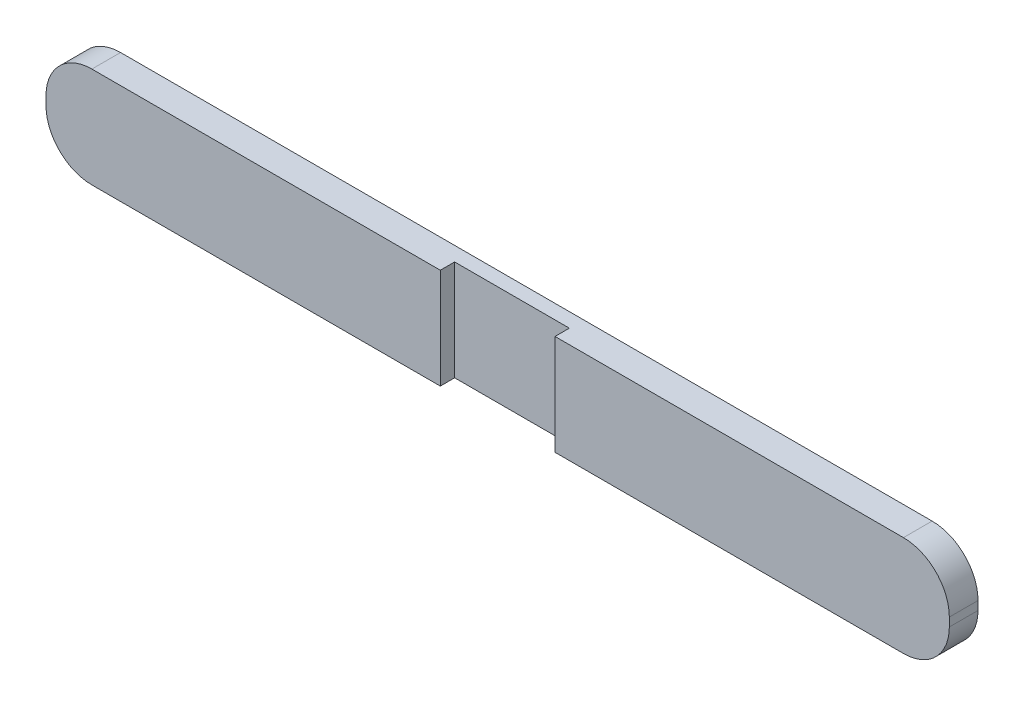
ISO-10303-21;
HEADER;
FILE_DESCRIPTION(('STEP AP214'),'2;1');
FILE_NAME('part.step','',(''),(''),'','','');
FILE_SCHEMA(('AUTOMOTIVE_DESIGN { 1 0 10303 214 1 1 1 1 }'));
ENDSEC;
DATA;
#1=APPLICATION_CONTEXT('core data for automotive mechanical design processes');
#2=APPLICATION_PROTOCOL_DEFINITION('international standard','automotive_design',2000,#1);
#3=PRODUCT_CONTEXT('',#1,'mechanical');
#4=PRODUCT('Part','Part','',(#3));
#5=PRODUCT_RELATED_PRODUCT_CATEGORY('part','',(#4));
#6=PRODUCT_DEFINITION_FORMATION('','',#4);
#7=PRODUCT_DEFINITION_CONTEXT('part definition',#1,'design');
#8=PRODUCT_DEFINITION('design','',#6,#7);
#9=PRODUCT_DEFINITION_SHAPE('','',#8);
#10=(LENGTH_UNIT() NAMED_UNIT(*) SI_UNIT(.MILLI.,.METRE.));
#11=(NAMED_UNIT(*) PLANE_ANGLE_UNIT() SI_UNIT($,.RADIAN.));
#12=(NAMED_UNIT(*) SI_UNIT($,.STERADIAN.) SOLID_ANGLE_UNIT());
#13=UNCERTAINTY_MEASURE_WITH_UNIT(LENGTH_MEASURE(1.E-05),#10,'distance_accuracy_value','');
#14=(GEOMETRIC_REPRESENTATION_CONTEXT(3) GLOBAL_UNCERTAINTY_ASSIGNED_CONTEXT((#13)) GLOBAL_UNIT_ASSIGNED_CONTEXT((#10,
#11,#12)) REPRESENTATION_CONTEXT('',''));
#15=CARTESIAN_POINT('',(0.,0.,0.));
#16=DIRECTION('',(0.,0.,1.));
#17=DIRECTION('',(1.,0.,0.));
#18=AXIS2_PLACEMENT_3D('',#15,#16,#17);
#19=CARTESIAN_POINT('',(28.1878048780488,-0.743414634146337,1.5875));
#20=DIRECTION('',(0.,0.,1.));
#21=DIRECTION('',(1.,0.,0.));
#22=AXIS2_PLACEMENT_3D('',#19,#20,#21);
#23=PLANE('',#22);
#24=DIRECTION('',(0.,1.,0.));
#25=VECTOR('',#24,1.);
#26=CARTESIAN_POINT('',(8.89967987804876,1.79658536585367,1.5875));
#27=LINE('',#26,#25);
#28=CARTESIAN_POINT('',(8.89967987804877,-3.75966463414634,1.5875));
#29=VERTEX_POINT('',#28);
#30=CARTESIAN_POINT('',(8.89967987804876,1.79658536585367,1.5875));
#31=VERTEX_POINT('',#30);
#32=EDGE_CURVE('E129',#29,#31,#27,.T.);
#33=ORIENTED_EDGE('',*,*,#32,.F.);
#34=DIRECTION('',(1.,0.,0.));
#35=VECTOR('',#34,1.);
#36=CARTESIAN_POINT('',(-16.7384451219512,-3.75966463414634,1.5875));
#37=LINE('',#36,#35);
#38=CARTESIAN_POINT('',(28.1878048780488,-3.75966463414634,1.5875));
#39=VERTEX_POINT('',#38);
#40=EDGE_CURVE('E123',#29,#39,#37,.T.);
#41=ORIENTED_EDGE('',*,*,#40,.T.);
#42=CARTESIAN_POINT('',(28.1878048780488,-1.21966463414634,1.5875));
#43=DIRECTION('',(0.,0.,1.));
#44=DIRECTION('',(1.,0.,0.));
#45=AXIS2_PLACEMENT_3D('',#42,#43,#44);
#46=CIRCLE('',#45,2.54);
#47=CARTESIAN_POINT('',(30.7278048780488,-1.21966463414634,1.5875));
#48=VERTEX_POINT('',#47);
#49=EDGE_CURVE('E126',#39,#48,#46,.T.);
#50=ORIENTED_EDGE('',*,*,#49,.T.);
#51=DIRECTION('',(0.,1.,0.));
#52=VECTOR('',#51,1.);
#53=CARTESIAN_POINT('',(30.7278048780488,-0.743414634146353,1.5875));
#54=LINE('',#53,#52);
#55=CARTESIAN_POINT('',(30.7278048780488,-0.743414634146353,1.5875));
#56=VERTEX_POINT('',#55);
#57=EDGE_CURVE('E64',#48,#56,#54,.T.);
#58=ORIENTED_EDGE('',*,*,#57,.T.);
#59=CARTESIAN_POINT('',(28.1878048780488,-0.743414634146337,1.5875));
#60=DIRECTION('',(0.,0.,1.));
#61=DIRECTION('',(1.,0.,0.));
#62=AXIS2_PLACEMENT_3D('',#59,#60,#61);
#63=CIRCLE('',#62,2.54);
#64=CARTESIAN_POINT('',(28.1878048780488,1.79658536585366,1.5875));
#65=VERTEX_POINT('',#64);
#66=EDGE_CURVE('E182',#56,#65,#63,.T.);
#67=ORIENTED_EDGE('',*,*,#66,.T.);
#68=DIRECTION('',(-1.,0.,0.));
#69=VECTOR('',#68,1.);
#70=CARTESIAN_POINT('',(-16.7384451219512,1.79658536585366,1.5875));
#71=LINE('',#70,#69);
#72=EDGE_CURVE('E105',#65,#31,#71,.T.);
#73=ORIENTED_EDGE('',*,*,#72,.T.);
#74=EDGE_LOOP('',(#33,#41,#50,#58,#67,#73));
#75=FACE_BOUND('',#74,.T.);
#76=ADVANCED_FACE('F39',(#75),#23,.T.);
#77=CARTESIAN_POINT('',(28.1878048780488,-0.743414634146337,1.5875));
#78=DIRECTION('',(0.,0.,-1.));
#79=DIRECTION('',(-1.,0.,0.));
#80=AXIS2_PLACEMENT_3D('',#77,#78,#79);
#81=CYLINDRICAL_SURFACE('',#80,2.54);
#82=CARTESIAN_POINT('',(28.1878048780488,-0.743414634146337,0.));
#83=DIRECTION('',(0.,0.,1.));
#84=DIRECTION('',(1.,0.,0.));
#85=AXIS2_PLACEMENT_3D('',#82,#83,#84);
#86=CIRCLE('',#85,2.54);
#87=CARTESIAN_POINT('',(30.7278048780488,-0.743414634146353,0.));
#88=VERTEX_POINT('',#87);
#89=CARTESIAN_POINT('',(28.1878048780488,1.79658536585366,0.));
#90=VERTEX_POINT('',#89);
#91=EDGE_CURVE('E158',#88,#90,#86,.T.);
#92=ORIENTED_EDGE('',*,*,#91,.T.);
#93=DIRECTION('',(0.,0.,-1.));
#94=VECTOR('',#93,1.);
#95=CARTESIAN_POINT('',(28.1878048780488,1.79658536585366,1.5875));
#96=LINE('',#95,#94);
#97=EDGE_CURVE('E11',#65,#90,#96,.T.);
#98=ORIENTED_EDGE('',*,*,#97,.F.);
#99=ORIENTED_EDGE('',*,*,#66,.F.);
#100=DIRECTION('',(0.,0.,-1.));
#101=VECTOR('',#100,1.);
#102=CARTESIAN_POINT('',(30.7278048780488,-0.743414634146353,1.5875));
#103=LINE('',#102,#101);
#104=EDGE_CURVE('E153',#56,#88,#103,.T.);
#105=ORIENTED_EDGE('',*,*,#104,.T.);
#106=EDGE_LOOP('',(#92,#98,#99,#105));
#107=FACE_BOUND('',#106,.T.);
#108=ADVANCED_FACE('F41',(#107),#81,.T.);
#109=CARTESIAN_POINT('',(-16.7384451219512,1.79658536585366,1.5875));
#110=DIRECTION('',(0.,-1.,0.));
#111=DIRECTION('',(0.,0.,-1.));
#112=AXIS2_PLACEMENT_3D('',#109,#110,#111);
#113=PLANE('',#112);
#114=DIRECTION('',(-1.,0.,0.));
#115=VECTOR('',#114,1.);
#116=CARTESIAN_POINT('',(8.89967987804876,1.79658536585367,0.79375));
#117=LINE('',#116,#115);
#118=CARTESIAN_POINT('',(8.89967987804876,1.79658536585367,0.79375));
#119=VERTEX_POINT('',#118);
#120=CARTESIAN_POINT('',(2.54967987804877,1.79658536585367,0.79375));
#121=VERTEX_POINT('',#120);
#122=EDGE_CURVE('E259',#119,#121,#117,.T.);
#123=ORIENTED_EDGE('',*,*,#122,.F.);
#124=DIRECTION('',(0.,0.,1.));
#125=VECTOR('',#124,1.);
#126=CARTESIAN_POINT('',(8.89967987804876,1.79658536585367,0.79375));
#127=LINE('',#126,#125);
#128=EDGE_CURVE('E233',#119,#31,#127,.T.);
#129=ORIENTED_EDGE('',*,*,#128,.T.);
#130=ORIENTED_EDGE('',*,*,#72,.F.);
#131=ORIENTED_EDGE('',*,*,#97,.T.);
#132=DIRECTION('',(-1.,0.,0.));
#133=VECTOR('',#132,1.);
#134=CARTESIAN_POINT('',(-16.7384451219512,1.79658536585366,0.));
#135=LINE('',#134,#133);
#136=CARTESIAN_POINT('',(-16.7384451219512,1.79658536585366,0.));
#137=VERTEX_POINT('',#136);
#138=EDGE_CURVE('E162',#90,#137,#135,.T.);
#139=ORIENTED_EDGE('',*,*,#138,.T.);
#140=DIRECTION('',(0.,0.,-1.));
#141=VECTOR('',#140,1.);
#142=CARTESIAN_POINT('',(-16.7384451219512,1.79658536585366,1.5875));
#143=LINE('',#142,#141);
#144=CARTESIAN_POINT('',(-16.7384451219512,1.79658536585366,1.5875));
#145=VERTEX_POINT('',#144);
#146=EDGE_CURVE('E48',#145,#137,#143,.T.);
#147=ORIENTED_EDGE('',*,*,#146,.F.);
#148=CARTESIAN_POINT('',(2.54967987804877,1.79658536585366,1.5875));
#149=VERTEX_POINT('',#148);
#150=EDGE_CURVE('E230',#149,#145,#71,.T.);
#151=ORIENTED_EDGE('',*,*,#150,.F.);
#152=DIRECTION('',(0.,0.,1.));
#153=VECTOR('',#152,1.);
#154=CARTESIAN_POINT('',(2.54967987804877,1.79658536585367,0.79375));
#155=LINE('',#154,#153);
#156=EDGE_CURVE('E55',#121,#149,#155,.T.);
#157=ORIENTED_EDGE('',*,*,#156,.F.);
#158=EDGE_LOOP('',(#123,#129,#130,#131,#139,#147,#151,#157));
#159=FACE_BOUND('',#158,.T.);
#160=ADVANCED_FACE('F275',(#159),#113,.F.);
#161=CARTESIAN_POINT('',(-16.7384451219512,-0.743414634146337,1.5875));
#162=DIRECTION('',(0.,0.,-1.));
#163=DIRECTION('',(-1.,0.,0.));
#164=AXIS2_PLACEMENT_3D('',#161,#162,#163);
#165=CYLINDRICAL_SURFACE('',#164,2.54);
#166=CARTESIAN_POINT('',(-16.7384451219512,-0.743414634146337,0.));
#167=DIRECTION('',(0.,0.,1.));
#168=DIRECTION('',(-1.,0.,0.));
#169=AXIS2_PLACEMENT_3D('',#166,#167,#168);
#170=CIRCLE('',#169,2.54);
#171=CARTESIAN_POINT('',(-19.2784451219512,-0.743414634146337,0.));
#172=VERTEX_POINT('',#171);
#173=EDGE_CURVE('E166',#137,#172,#170,.T.);
#174=ORIENTED_EDGE('',*,*,#173,.T.);
#175=DIRECTION('',(0.,0.,-1.));
#176=VECTOR('',#175,1.);
#177=CARTESIAN_POINT('',(-19.2784451219512,-0.743414634146337,1.5875));
#178=LINE('',#177,#176);
#179=CARTESIAN_POINT('',(-19.2784451219512,-0.743414634146337,1.5875));
#180=VERTEX_POINT('',#179);
#181=EDGE_CURVE('E193',#180,#172,#178,.T.);
#182=ORIENTED_EDGE('',*,*,#181,.F.);
#183=CARTESIAN_POINT('',(-16.7384451219512,-0.743414634146337,1.5875));
#184=DIRECTION('',(0.,0.,1.));
#185=DIRECTION('',(-1.,0.,0.));
#186=AXIS2_PLACEMENT_3D('',#183,#184,#185);
#187=CIRCLE('',#186,2.54);
#188=EDGE_CURVE('E204',#145,#180,#187,.T.);
#189=ORIENTED_EDGE('',*,*,#188,.F.);
#190=ORIENTED_EDGE('',*,*,#146,.T.);
#191=EDGE_LOOP('',(#174,#182,#189,#190));
#192=FACE_BOUND('',#191,.T.);
#193=ADVANCED_FACE('F202',(#192),#165,.T.);
#194=CARTESIAN_POINT('',(-19.2784451219512,-0.743414634146337,1.5875));
#195=DIRECTION('',(1.,0.,0.));
#196=DIRECTION('',(0.,0.,-1.));
#197=AXIS2_PLACEMENT_3D('',#194,#195,#196);
#198=PLANE('',#197);
#199=DIRECTION('',(0.,-1.,0.));
#200=VECTOR('',#199,1.);
#201=CARTESIAN_POINT('',(-19.2784451219512,-0.743414634146337,0.));
#202=LINE('',#201,#200);
#203=CARTESIAN_POINT('',(-19.2784451219512,-1.21966463414634,0.));
#204=VERTEX_POINT('',#203);
#205=EDGE_CURVE('E169',#172,#204,#202,.T.);
#206=ORIENTED_EDGE('',*,*,#205,.T.);
#207=DIRECTION('',(0.,0.,-1.));
#208=VECTOR('',#207,1.);
#209=CARTESIAN_POINT('',(-19.2784451219512,-1.21966463414634,1.5875));
#210=LINE('',#209,#208);
#211=CARTESIAN_POINT('',(-19.2784451219512,-1.21966463414634,1.5875));
#212=VERTEX_POINT('',#211);
#213=EDGE_CURVE('E189',#212,#204,#210,.T.);
#214=ORIENTED_EDGE('',*,*,#213,.F.);
#215=DIRECTION('',(0.,-1.,0.));
#216=VECTOR('',#215,1.);
#217=CARTESIAN_POINT('',(-19.2784451219512,-0.743414634146337,1.5875));
#218=LINE('',#217,#216);
#219=EDGE_CURVE('E222',#180,#212,#218,.T.);
#220=ORIENTED_EDGE('',*,*,#219,.F.);
#221=ORIENTED_EDGE('',*,*,#181,.T.);
#222=EDGE_LOOP('',(#206,#214,#220,#221));
#223=FACE_BOUND('',#222,.T.);
#224=ADVANCED_FACE('F213',(#223),#198,.F.);
#225=CARTESIAN_POINT('',(-16.7384451219512,-1.21966463414634,1.5875));
#226=DIRECTION('',(0.,0.,-1.));
#227=DIRECTION('',(-1.,0.,0.));
#228=AXIS2_PLACEMENT_3D('',#225,#226,#227);
#229=CYLINDRICAL_SURFACE('',#228,2.54);
#230=CARTESIAN_POINT('',(-16.7384451219512,-1.21966463414634,0.));
#231=DIRECTION('',(0.,0.,1.));
#232=DIRECTION('',(1.,0.,0.));
#233=AXIS2_PLACEMENT_3D('',#230,#231,#232);
#234=CIRCLE('',#233,2.54);
#235=CARTESIAN_POINT('',(-16.7384451219512,-3.75966463414634,0.));
#236=VERTEX_POINT('',#235);
#237=EDGE_CURVE('E172',#204,#236,#234,.T.);
#238=ORIENTED_EDGE('',*,*,#237,.T.);
#239=DIRECTION('',(0.,0.,-1.));
#240=VECTOR('',#239,1.);
#241=CARTESIAN_POINT('',(-16.7384451219512,-3.75966463414634,1.5875));
#242=LINE('',#241,#240);
#243=CARTESIAN_POINT('',(-16.7384451219512,-3.75966463414634,1.5875));
#244=VERTEX_POINT('',#243);
#245=EDGE_CURVE('E145',#244,#236,#242,.T.);
#246=ORIENTED_EDGE('',*,*,#245,.F.);
#247=CARTESIAN_POINT('',(-16.7384451219512,-1.21966463414634,1.5875));
#248=DIRECTION('',(0.,0.,1.));
#249=DIRECTION('',(1.,0.,0.));
#250=AXIS2_PLACEMENT_3D('',#247,#248,#249);
#251=CIRCLE('',#250,2.54);
#252=EDGE_CURVE('E134',#212,#244,#251,.T.);
#253=ORIENTED_EDGE('',*,*,#252,.F.);
#254=ORIENTED_EDGE('',*,*,#213,.T.);
#255=EDGE_LOOP('',(#238,#246,#253,#254));
#256=FACE_BOUND('',#255,.T.);
#257=ADVANCED_FACE('F217',(#256),#229,.T.);
#258=CARTESIAN_POINT('',(-16.7384451219512,-3.75966463414634,1.5875));
#259=DIRECTION('',(0.,1.,0.));
#260=DIRECTION('',(0.,0.,1.));
#261=AXIS2_PLACEMENT_3D('',#258,#259,#260);
#262=PLANE('',#261);
#263=ORIENTED_EDGE('',*,*,#40,.F.);
#264=DIRECTION('',(0.,0.,1.));
#265=VECTOR('',#264,1.);
#266=CARTESIAN_POINT('',(8.89967987804877,-3.75966463414634,0.79375));
#267=LINE('',#266,#265);
#268=CARTESIAN_POINT('',(8.89967987804877,-3.75966463414634,0.79375));
#269=VERTEX_POINT('',#268);
#270=EDGE_CURVE('E163',#269,#29,#267,.T.);
#271=ORIENTED_EDGE('',*,*,#270,.F.);
#272=DIRECTION('',(1.,0.,0.));
#273=VECTOR('',#272,1.);
#274=CARTESIAN_POINT('',(8.89967987804877,-3.75966463414634,0.79375));
#275=LINE('',#274,#273);
#276=CARTESIAN_POINT('',(2.54967987804877,-3.75966463414634,0.79375));
#277=VERTEX_POINT('',#276);
#278=EDGE_CURVE('E236',#277,#269,#275,.T.);
#279=ORIENTED_EDGE('',*,*,#278,.F.);
#280=DIRECTION('',(0.,0.,1.));
#281=VECTOR('',#280,1.);
#282=CARTESIAN_POINT('',(2.54967987804877,-3.75966463414634,0.79375));
#283=LINE('',#282,#281);
#284=CARTESIAN_POINT('',(2.54967987804877,-3.75966463414634,1.5875));
#285=VERTEX_POINT('',#284);
#286=EDGE_CURVE('E239',#277,#285,#283,.T.);
#287=ORIENTED_EDGE('',*,*,#286,.T.);
#288=EDGE_CURVE('E133',#244,#285,#37,.T.);
#289=ORIENTED_EDGE('',*,*,#288,.F.);
#290=ORIENTED_EDGE('',*,*,#245,.T.);
#291=DIRECTION('',(1.,0.,0.));
#292=VECTOR('',#291,1.);
#293=CARTESIAN_POINT('',(-16.7384451219512,-3.75966463414634,0.));
#294=LINE('',#293,#292);
#295=CARTESIAN_POINT('',(28.1878048780488,-3.75966463414634,0.));
#296=VERTEX_POINT('',#295);
#297=EDGE_CURVE('E141',#236,#296,#294,.T.);
#298=ORIENTED_EDGE('',*,*,#297,.T.);
#299=DIRECTION('',(0.,0.,-1.));
#300=VECTOR('',#299,1.);
#301=CARTESIAN_POINT('',(28.1878048780488,-3.75966463414634,1.5875));
#302=LINE('',#301,#300);
#303=EDGE_CURVE('E137',#39,#296,#302,.T.);
#304=ORIENTED_EDGE('',*,*,#303,.F.);
#305=EDGE_LOOP('',(#263,#271,#279,#287,#289,#290,#298,#304));
#306=FACE_BOUND('',#305,.T.);
#307=ADVANCED_FACE('F138',(#306),#262,.F.);
#308=CARTESIAN_POINT('',(28.1878048780488,-1.21966463414634,1.5875));
#309=DIRECTION('',(0.,0.,-1.));
#310=DIRECTION('',(-1.,0.,0.));
#311=AXIS2_PLACEMENT_3D('',#308,#309,#310);
#312=CYLINDRICAL_SURFACE('',#311,2.54);
#313=CARTESIAN_POINT('',(28.1878048780488,-1.21966463414634,0.));
#314=DIRECTION('',(0.,0.,1.));
#315=DIRECTION('',(1.,0.,0.));
#316=AXIS2_PLACEMENT_3D('',#313,#314,#315);
#317=CIRCLE('',#316,2.54);
#318=CARTESIAN_POINT('',(30.7278048780488,-1.21966463414634,0.));
#319=VERTEX_POINT('',#318);
#320=EDGE_CURVE('E177',#296,#319,#317,.T.);
#321=ORIENTED_EDGE('',*,*,#320,.T.);
#322=DIRECTION('',(0.,0.,-1.));
#323=VECTOR('',#322,1.);
#324=CARTESIAN_POINT('',(30.7278048780488,-1.21966463414634,1.5875));
#325=LINE('',#324,#323);
#326=EDGE_CURVE('E146',#48,#319,#325,.T.);
#327=ORIENTED_EDGE('',*,*,#326,.F.);
#328=ORIENTED_EDGE('',*,*,#49,.F.);
#329=ORIENTED_EDGE('',*,*,#303,.T.);
#330=EDGE_LOOP('',(#321,#327,#328,#329));
#331=FACE_BOUND('',#330,.T.);
#332=ADVANCED_FACE('F148',(#331),#312,.T.);
#333=CARTESIAN_POINT('',(30.7278048780488,-0.743414634146353,1.5875));
#334=DIRECTION('',(-1.,0.,0.));
#335=DIRECTION('',(0.,0.,1.));
#336=AXIS2_PLACEMENT_3D('',#333,#334,#335);
#337=PLANE('',#336);
#338=DIRECTION('',(0.,1.,0.));
#339=VECTOR('',#338,1.);
#340=CARTESIAN_POINT('',(30.7278048780488,-0.743414634146353,0.));
#341=LINE('',#340,#339);
#342=EDGE_CURVE('E97',#319,#88,#341,.T.);
#343=ORIENTED_EDGE('',*,*,#342,.T.);
#344=ORIENTED_EDGE('',*,*,#104,.F.);
#345=ORIENTED_EDGE('',*,*,#57,.F.);
#346=ORIENTED_EDGE('',*,*,#326,.T.);
#347=EDGE_LOOP('',(#343,#344,#345,#346));
#348=FACE_BOUND('',#347,.T.);
#349=ADVANCED_FACE('F288',(#348),#337,.F.);
#350=DIRECTION('',(0.,-1.,0.));
#351=VECTOR('',#350,1.);
#352=CARTESIAN_POINT('',(2.54967987804877,1.79658536585367,1.5875));
#353=LINE('',#352,#351);
#354=EDGE_CURVE('E246',#149,#285,#353,.T.);
#355=ORIENTED_EDGE('',*,*,#354,.F.);
#356=ORIENTED_EDGE('',*,*,#150,.T.);
#357=ORIENTED_EDGE('',*,*,#188,.T.);
#358=ORIENTED_EDGE('',*,*,#219,.T.);
#359=ORIENTED_EDGE('',*,*,#252,.T.);
#360=ORIENTED_EDGE('',*,*,#288,.T.);
#361=EDGE_LOOP('',(#355,#356,#357,#358,#359,#360));
#362=FACE_BOUND('',#361,.T.);
#363=ADVANCED_FACE('F285',(#362),#23,.T.);
#364=CARTESIAN_POINT('',(28.1878048780488,-0.743414634146337,0.));
#365=DIRECTION('',(0.,0.,1.));
#366=DIRECTION('',(1.,0.,0.));
#367=AXIS2_PLACEMENT_3D('',#364,#365,#366);
#368=PLANE('',#367);
#369=ORIENTED_EDGE('',*,*,#91,.F.);
#370=ORIENTED_EDGE('',*,*,#342,.F.);
#371=ORIENTED_EDGE('',*,*,#320,.F.);
#372=ORIENTED_EDGE('',*,*,#297,.F.);
#373=ORIENTED_EDGE('',*,*,#237,.F.);
#374=ORIENTED_EDGE('',*,*,#205,.F.);
#375=ORIENTED_EDGE('',*,*,#173,.F.);
#376=ORIENTED_EDGE('',*,*,#138,.F.);
#377=EDGE_LOOP('',(#369,#370,#371,#372,#373,#374,#375,#376));
#378=FACE_BOUND('',#377,.T.);
#379=ADVANCED_FACE('F209',(#378),#368,.F.);
#380=CARTESIAN_POINT('',(8.89967987804876,1.79658536585367,0.79375));
#381=DIRECTION('',(1.,0.,0.));
#382=DIRECTION('',(0.,1.,0.));
#383=AXIS2_PLACEMENT_3D('',#380,#381,#382);
#384=PLANE('',#383);
#385=ORIENTED_EDGE('',*,*,#32,.T.);
#386=ORIENTED_EDGE('',*,*,#128,.F.);
#387=DIRECTION('',(0.,1.,0.));
#388=VECTOR('',#387,1.);
#389=CARTESIAN_POINT('',(8.89967987804876,1.79658536585367,0.79375));
#390=LINE('',#389,#388);
#391=EDGE_CURVE('E249',#269,#119,#390,.T.);
#392=ORIENTED_EDGE('',*,*,#391,.F.);
#393=ORIENTED_EDGE('',*,*,#270,.T.);
#394=EDGE_LOOP('',(#385,#386,#392,#393));
#395=FACE_BOUND('',#394,.T.);
#396=ADVANCED_FACE('F284',(#395),#384,.F.);
#397=CARTESIAN_POINT('',(2.54967987804877,1.79658536585367,0.79375));
#398=DIRECTION('',(-1.,0.,0.));
#399=DIRECTION('',(0.,-1.,0.));
#400=AXIS2_PLACEMENT_3D('',#397,#398,#399);
#401=PLANE('',#400);
#402=ORIENTED_EDGE('',*,*,#354,.T.);
#403=ORIENTED_EDGE('',*,*,#286,.F.);
#404=DIRECTION('',(0.,-1.,0.));
#405=VECTOR('',#404,1.);
#406=CARTESIAN_POINT('',(2.54967987804877,1.79658536585367,0.79375));
#407=LINE('',#406,#405);
#408=EDGE_CURVE('E255',#121,#277,#407,.T.);
#409=ORIENTED_EDGE('',*,*,#408,.F.);
#410=ORIENTED_EDGE('',*,*,#156,.T.);
#411=EDGE_LOOP('',(#402,#403,#409,#410));
#412=FACE_BOUND('',#411,.T.);
#413=ADVANCED_FACE('F362',(#412),#401,.F.);
#414=CARTESIAN_POINT('',(0.,0.,0.79375));
#415=DIRECTION('',(0.,0.,-1.));
#416=DIRECTION('',(-1.,0.,0.));
#417=AXIS2_PLACEMENT_3D('',#414,#415,#416);
#418=PLANE('',#417);
#419=ORIENTED_EDGE('',*,*,#391,.T.);
#420=ORIENTED_EDGE('',*,*,#122,.T.);
#421=ORIENTED_EDGE('',*,*,#408,.T.);
#422=ORIENTED_EDGE('',*,*,#278,.T.);
#423=EDGE_LOOP('',(#419,#420,#421,#422));
#424=FACE_BOUND('',#423,.T.);
#425=ADVANCED_FACE('F269',(#424),#418,.F.);
#426=CLOSED_SHELL('',(#76,#108,#160,#193,#224,#257,#307,#332,#349,#363,#379,#396,#413,#425));
#427=MANIFOLD_SOLID_BREP('B2',#426);
#428=ADVANCED_BREP_SHAPE_REPRESENTATION('',(#18,#427),#14);
#429=SHAPE_DEFINITION_REPRESENTATION(#9,#428);
ENDSEC;
END-ISO-10303-21;
